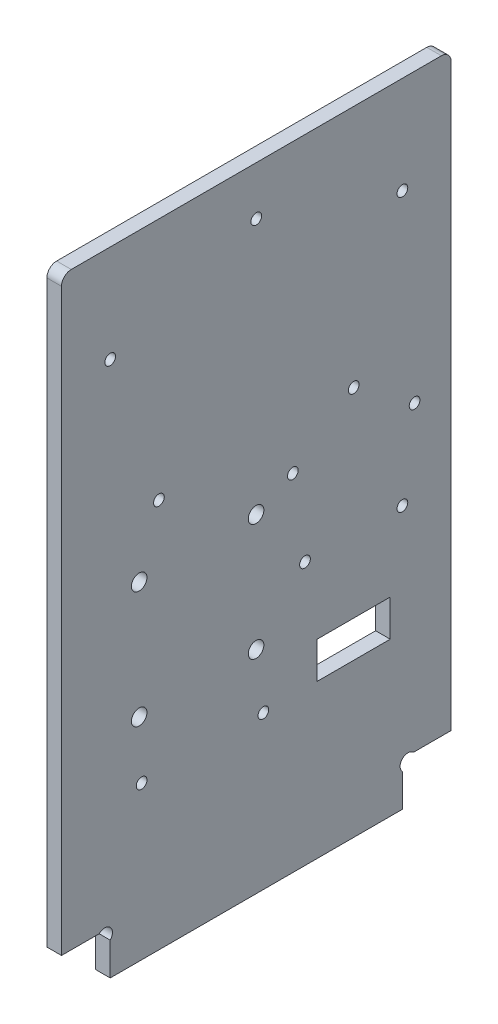
ISO-10303-21;
HEADER;
FILE_DESCRIPTION(('STEP AP214'),'2;1');
FILE_NAME('part.step','',(''),(''),'','','');
FILE_SCHEMA(('AUTOMOTIVE_DESIGN { 1 0 10303 214 1 1 1 1 }'));
ENDSEC;
DATA;
#1=APPLICATION_CONTEXT('core data for automotive mechanical design processes');
#2=APPLICATION_PROTOCOL_DEFINITION('international standard','automotive_design',2000,#1);
#3=PRODUCT_CONTEXT('',#1,'mechanical');
#4=PRODUCT('Part','Part','',(#3));
#5=PRODUCT_RELATED_PRODUCT_CATEGORY('part','',(#4));
#6=PRODUCT_DEFINITION_FORMATION('','',#4);
#7=PRODUCT_DEFINITION_CONTEXT('part definition',#1,'design');
#8=PRODUCT_DEFINITION('design','',#6,#7);
#9=PRODUCT_DEFINITION_SHAPE('','',#8);
#10=(LENGTH_UNIT() NAMED_UNIT(*) SI_UNIT(.MILLI.,.METRE.));
#11=(NAMED_UNIT(*) PLANE_ANGLE_UNIT() SI_UNIT($,.RADIAN.));
#12=(NAMED_UNIT(*) SI_UNIT($,.STERADIAN.) SOLID_ANGLE_UNIT());
#13=UNCERTAINTY_MEASURE_WITH_UNIT(LENGTH_MEASURE(1.E-05),#10,'distance_accuracy_value','');
#14=(GEOMETRIC_REPRESENTATION_CONTEXT(3) GLOBAL_UNCERTAINTY_ASSIGNED_CONTEXT((#13)) GLOBAL_UNIT_ASSIGNED_CONTEXT((#10,
#11,#12)) REPRESENTATION_CONTEXT('',''));
#15=CARTESIAN_POINT('',(0.,0.,0.));
#16=DIRECTION('',(0.,0.,1.));
#17=DIRECTION('',(1.,0.,0.));
#18=AXIS2_PLACEMENT_3D('',#15,#16,#17);
#19=CARTESIAN_POINT('',(3.,7.86862915010153,-8.86862915010152));
#20=DIRECTION('',(-1.,0.,0.));
#21=DIRECTION('',(0.,0.,1.));
#22=AXIS2_PLACEMENT_3D('',#19,#20,#21);
#23=CYLINDRICAL_SURFACE('',#22,1.6);
#24=CARTESIAN_POINT('',(0.,7.86862915010153,-8.86862915010152));
#25=DIRECTION('',(-1.,0.,0.));
#26=DIRECTION('',(0.,0.,-1.));
#27=AXIS2_PLACEMENT_3D('',#24,#25,#26);
#28=CIRCLE('',#27,1.6);
#29=CARTESIAN_POINT('',(0.,9.,-7.73725830020304));
#30=VERTEX_POINT('',#29);
#31=CARTESIAN_POINT('',(0.,6.73725830020305,-10.));
#32=VERTEX_POINT('',#31);
#33=EDGE_CURVE('E259',#30,#32,#28,.T.);
#34=ORIENTED_EDGE('',*,*,#33,.T.);
#35=DIRECTION('',(-1.,0.,0.));
#36=VECTOR('',#35,1.);
#37=CARTESIAN_POINT('',(3.,6.73725830020305,-10.));
#38=LINE('',#37,#36);
#39=CARTESIAN_POINT('',(3.,6.73725830020305,-10.));
#40=VERTEX_POINT('',#39);
#41=EDGE_CURVE('E325',#40,#32,#38,.T.);
#42=ORIENTED_EDGE('',*,*,#41,.F.);
#43=CARTESIAN_POINT('',(3.,7.86862915010153,-8.86862915010152));
#44=DIRECTION('',(-1.,0.,0.));
#45=DIRECTION('',(0.,0.,-1.));
#46=AXIS2_PLACEMENT_3D('',#43,#44,#45);
#47=CIRCLE('',#46,1.6);
#48=CARTESIAN_POINT('',(3.,9.,-7.73725830020304));
#49=VERTEX_POINT('',#48);
#50=EDGE_CURVE('E262',#49,#40,#47,.T.);
#51=ORIENTED_EDGE('',*,*,#50,.F.);
#52=DIRECTION('',(-1.,0.,0.));
#53=VECTOR('',#52,1.);
#54=CARTESIAN_POINT('',(3.,9.,-7.73725830020304));
#55=LINE('',#54,#53);
#56=EDGE_CURVE('E284',#49,#30,#55,.T.);
#57=ORIENTED_EDGE('',*,*,#56,.T.);
#58=EDGE_LOOP('',(#34,#42,#51,#57));
#59=FACE_BOUND('',#58,.T.);
#60=ADVANCED_FACE('F32',(#59),#23,.F.);
#61=CARTESIAN_POINT('',(3.,6.73725830020305,-10.));
#62=DIRECTION('',(0.,0.,-1.));
#63=DIRECTION('',(-1.,0.,0.));
#64=AXIS2_PLACEMENT_3D('',#61,#62,#63);
#65=PLANE('',#64);
#66=DIRECTION('',(0.,-1.,0.));
#67=VECTOR('',#66,1.);
#68=CARTESIAN_POINT('',(0.,6.73725830020305,-10.));
#69=LINE('',#68,#67);
#70=CARTESIAN_POINT('',(0.,0.,-10.));
#71=VERTEX_POINT('',#70);
#72=EDGE_CURVE('E287',#32,#71,#69,.T.);
#73=ORIENTED_EDGE('',*,*,#72,.T.);
#74=DIRECTION('',(-1.,0.,0.));
#75=VECTOR('',#74,1.);
#76=CARTESIAN_POINT('',(3.,0.,-10.));
#77=LINE('',#76,#75);
#78=CARTESIAN_POINT('',(3.,0.,-10.));
#79=VERTEX_POINT('',#78);
#80=EDGE_CURVE('E322',#79,#71,#77,.T.);
#81=ORIENTED_EDGE('',*,*,#80,.F.);
#82=DIRECTION('',(0.,-1.,0.));
#83=VECTOR('',#82,1.);
#84=CARTESIAN_POINT('',(3.,6.73725830020305,-10.));
#85=LINE('',#84,#83);
#86=EDGE_CURVE('E265',#40,#79,#85,.T.);
#87=ORIENTED_EDGE('',*,*,#86,.F.);
#88=ORIENTED_EDGE('',*,*,#41,.T.);
#89=EDGE_LOOP('',(#73,#81,#87,#88));
#90=FACE_BOUND('',#89,.T.);
#91=ADVANCED_FACE('F376',(#90),#65,.F.);
#92=CARTESIAN_POINT('',(3.,0.,-10.));
#93=DIRECTION('',(0.,1.,0.));
#94=DIRECTION('',(0.,0.,1.));
#95=AXIS2_PLACEMENT_3D('',#92,#93,#94);
#96=PLANE('',#95);
#97=DIRECTION('',(0.,0.,-1.));
#98=VECTOR('',#97,1.);
#99=CARTESIAN_POINT('',(0.,0.,-10.));
#100=LINE('',#99,#98);
#101=CARTESIAN_POINT('',(0.,0.,-70.));
#102=VERTEX_POINT('',#101);
#103=EDGE_CURVE('E289',#71,#102,#100,.T.);
#104=ORIENTED_EDGE('',*,*,#103,.T.);
#105=DIRECTION('',(-1.,0.,0.));
#106=VECTOR('',#105,1.);
#107=CARTESIAN_POINT('',(3.,0.,-70.));
#108=LINE('',#107,#106);
#109=CARTESIAN_POINT('',(3.,0.,-70.));
#110=VERTEX_POINT('',#109);
#111=EDGE_CURVE('E319',#110,#102,#108,.T.);
#112=ORIENTED_EDGE('',*,*,#111,.F.);
#113=DIRECTION('',(0.,0.,-1.));
#114=VECTOR('',#113,1.);
#115=CARTESIAN_POINT('',(3.,0.,-10.));
#116=LINE('',#115,#114);
#117=EDGE_CURVE('E268',#79,#110,#116,.T.);
#118=ORIENTED_EDGE('',*,*,#117,.F.);
#119=ORIENTED_EDGE('',*,*,#80,.T.);
#120=EDGE_LOOP('',(#104,#112,#118,#119));
#121=FACE_BOUND('',#120,.T.);
#122=ADVANCED_FACE('F370',(#121),#96,.F.);
#123=CARTESIAN_POINT('',(3.,6.73725830020307,-70.));
#124=DIRECTION('',(0.,0.,1.));
#125=DIRECTION('',(0.,-1.,0.));
#126=AXIS2_PLACEMENT_3D('',#123,#124,#125);
#127=PLANE('',#126);
#128=DIRECTION('',(0.,1.,0.));
#129=VECTOR('',#128,1.);
#130=CARTESIAN_POINT('',(0.,6.73725830020307,-70.));
#131=LINE('',#130,#129);
#132=CARTESIAN_POINT('',(0.,6.73725830020307,-70.));
#133=VERTEX_POINT('',#132);
#134=EDGE_CURVE('E291',#102,#133,#131,.T.);
#135=ORIENTED_EDGE('',*,*,#134,.T.);
#136=DIRECTION('',(-1.,0.,0.));
#137=VECTOR('',#136,1.);
#138=CARTESIAN_POINT('',(3.,6.73725830020307,-70.));
#139=LINE('',#138,#137);
#140=CARTESIAN_POINT('',(3.,6.73725830020307,-70.));
#141=VERTEX_POINT('',#140);
#142=EDGE_CURVE('E316',#141,#133,#139,.T.);
#143=ORIENTED_EDGE('',*,*,#142,.F.);
#144=DIRECTION('',(0.,1.,0.));
#145=VECTOR('',#144,1.);
#146=CARTESIAN_POINT('',(3.,6.73725830020307,-70.));
#147=LINE('',#146,#145);
#148=EDGE_CURVE('E270',#110,#141,#147,.T.);
#149=ORIENTED_EDGE('',*,*,#148,.F.);
#150=ORIENTED_EDGE('',*,*,#111,.T.);
#151=EDGE_LOOP('',(#135,#143,#149,#150));
#152=FACE_BOUND('',#151,.T.);
#153=ADVANCED_FACE('F366',(#152),#127,.F.);
#154=CARTESIAN_POINT('',(3.,7.86862915010154,-71.1313708498985));
#155=DIRECTION('',(-1.,0.,0.));
#156=DIRECTION('',(0.,0.,1.));
#157=AXIS2_PLACEMENT_3D('',#154,#155,#156);
#158=CYLINDRICAL_SURFACE('',#157,1.6);
#159=CARTESIAN_POINT('',(0.,7.86862915010154,-71.1313708498985));
#160=DIRECTION('',(-1.,0.,0.));
#161=DIRECTION('',(0.,0.,1.));
#162=AXIS2_PLACEMENT_3D('',#159,#160,#161);
#163=CIRCLE('',#162,1.6);
#164=CARTESIAN_POINT('',(0.,8.99999999999999,-72.262741699797));
#165=VERTEX_POINT('',#164);
#166=EDGE_CURVE('E293',#133,#165,#163,.T.);
#167=ORIENTED_EDGE('',*,*,#166,.T.);
#168=DIRECTION('',(-1.,0.,0.));
#169=VECTOR('',#168,1.);
#170=CARTESIAN_POINT('',(3.,8.99999999999999,-72.262741699797));
#171=LINE('',#170,#169);
#172=CARTESIAN_POINT('',(3.,8.99999999999999,-72.262741699797));
#173=VERTEX_POINT('',#172);
#174=EDGE_CURVE('E313',#173,#165,#171,.T.);
#175=ORIENTED_EDGE('',*,*,#174,.F.);
#176=CARTESIAN_POINT('',(3.,7.86862915010154,-71.1313708498985));
#177=DIRECTION('',(-1.,0.,0.));
#178=DIRECTION('',(0.,0.,1.));
#179=AXIS2_PLACEMENT_3D('',#176,#177,#178);
#180=CIRCLE('',#179,1.6);
#181=EDGE_CURVE('E272',#141,#173,#180,.T.);
#182=ORIENTED_EDGE('',*,*,#181,.F.);
#183=ORIENTED_EDGE('',*,*,#142,.T.);
#184=EDGE_LOOP('',(#167,#175,#182,#183));
#185=FACE_BOUND('',#184,.T.);
#186=ADVANCED_FACE('F361',(#185),#158,.F.);
#187=CARTESIAN_POINT('',(3.,8.99999999999999,-72.262741699797));
#188=DIRECTION('',(0.,1.,0.));
#189=DIRECTION('',(0.,0.,1.));
#190=AXIS2_PLACEMENT_3D('',#187,#188,#189);
#191=PLANE('',#190);
#192=DIRECTION('',(0.,0.,-1.));
#193=VECTOR('',#192,1.);
#194=CARTESIAN_POINT('',(0.,8.99999999999999,-72.262741699797));
#195=LINE('',#194,#193);
#196=CARTESIAN_POINT('',(0.,8.99999999999999,-80.));
#197=VERTEX_POINT('',#196);
#198=EDGE_CURVE('E295',#165,#197,#195,.T.);
#199=ORIENTED_EDGE('',*,*,#198,.T.);
#200=DIRECTION('',(-1.,0.,0.));
#201=VECTOR('',#200,1.);
#202=CARTESIAN_POINT('',(3.,8.99999999999999,-80.));
#203=LINE('',#202,#201);
#204=CARTESIAN_POINT('',(3.,8.99999999999999,-80.));
#205=VERTEX_POINT('',#204);
#206=EDGE_CURVE('E310',#205,#197,#203,.T.);
#207=ORIENTED_EDGE('',*,*,#206,.F.);
#208=DIRECTION('',(0.,0.,-1.));
#209=VECTOR('',#208,1.);
#210=CARTESIAN_POINT('',(3.,8.99999999999999,-72.262741699797));
#211=LINE('',#210,#209);
#212=EDGE_CURVE('E274',#173,#205,#211,.T.);
#213=ORIENTED_EDGE('',*,*,#212,.F.);
#214=ORIENTED_EDGE('',*,*,#174,.T.);
#215=EDGE_LOOP('',(#199,#207,#213,#214));
#216=FACE_BOUND('',#215,.T.);
#217=ADVANCED_FACE('F355',(#216),#191,.F.);
#218=CARTESIAN_POINT('',(3.,130.,-80.));
#219=DIRECTION('',(0.,0.,1.));
#220=DIRECTION('',(0.,-1.,0.));
#221=AXIS2_PLACEMENT_3D('',#218,#219,#220);
#222=PLANE('',#221);
#223=DIRECTION('',(0.,1.,0.));
#224=VECTOR('',#223,1.);
#225=CARTESIAN_POINT('',(0.,130.,-80.));
#226=LINE('',#225,#224);
#227=CARTESIAN_POINT('',(0.,128.,-80.));
#228=VERTEX_POINT('',#227);
#229=EDGE_CURVE('E297',#197,#228,#226,.T.);
#230=ORIENTED_EDGE('',*,*,#229,.T.);
#231=DIRECTION('',(-1.,0.,0.));
#232=VECTOR('',#231,1.);
#233=CARTESIAN_POINT('',(3.,128.,-80.));
#234=LINE('',#233,#232);
#235=CARTESIAN_POINT('',(3.,128.,-80.));
#236=VERTEX_POINT('',#235);
#237=EDGE_CURVE('E55',#228,#236,#234,.F.);
#238=ORIENTED_EDGE('',*,*,#237,.T.);
#239=DIRECTION('',(0.,1.,0.));
#240=VECTOR('',#239,1.);
#241=CARTESIAN_POINT('',(3.,130.,-80.));
#242=LINE('',#241,#240);
#243=EDGE_CURVE('E276',#205,#236,#242,.T.);
#244=ORIENTED_EDGE('',*,*,#243,.F.);
#245=ORIENTED_EDGE('',*,*,#206,.T.);
#246=EDGE_LOOP('',(#230,#238,#244,#245));
#247=FACE_BOUND('',#246,.T.);
#248=ADVANCED_FACE('F351',(#247),#222,.F.);
#249=CARTESIAN_POINT('',(3.,130.,0.));
#250=DIRECTION('',(0.,-1.,0.));
#251=DIRECTION('',(0.,0.,-1.));
#252=AXIS2_PLACEMENT_3D('',#249,#250,#251);
#253=PLANE('',#252);
#254=DIRECTION('',(0.,0.,1.));
#255=VECTOR('',#254,1.);
#256=CARTESIAN_POINT('',(3.,130.,0.));
#257=LINE('',#256,#255);
#258=CARTESIAN_POINT('',(3.,130.,-78.));
#259=VERTEX_POINT('',#258);
#260=CARTESIAN_POINT('',(3.,130.,-2.));
#261=VERTEX_POINT('',#260);
#262=EDGE_CURVE('E278',#259,#261,#257,.T.);
#263=ORIENTED_EDGE('',*,*,#262,.F.);
#264=DIRECTION('',(-1.,0.,0.));
#265=VECTOR('',#264,1.);
#266=CARTESIAN_POINT('',(3.,130.,-78.));
#267=LINE('',#266,#265);
#268=CARTESIAN_POINT('',(0.,130.,-78.));
#269=VERTEX_POINT('',#268);
#270=EDGE_CURVE('E330',#259,#269,#267,.T.);
#271=ORIENTED_EDGE('',*,*,#270,.T.);
#272=DIRECTION('',(0.,0.,1.));
#273=VECTOR('',#272,1.);
#274=CARTESIAN_POINT('',(0.,130.,0.));
#275=LINE('',#274,#273);
#276=CARTESIAN_POINT('',(0.,130.,-2.));
#277=VERTEX_POINT('',#276);
#278=EDGE_CURVE('E299',#269,#277,#275,.T.);
#279=ORIENTED_EDGE('',*,*,#278,.T.);
#280=DIRECTION('',(-1.,0.,0.));
#281=VECTOR('',#280,1.);
#282=CARTESIAN_POINT('',(3.,130.,-2.));
#283=LINE('',#282,#281);
#284=EDGE_CURVE('E328',#277,#261,#283,.F.);
#285=ORIENTED_EDGE('',*,*,#284,.T.);
#286=EDGE_LOOP('',(#263,#271,#279,#285));
#287=FACE_BOUND('',#286,.T.);
#288=ADVANCED_FACE('F343',(#287),#253,.F.);
#289=CARTESIAN_POINT('',(3.,9.,0.));
#290=DIRECTION('',(0.,0.,-1.));
#291=DIRECTION('',(-1.,0.,0.));
#292=AXIS2_PLACEMENT_3D('',#289,#290,#291);
#293=PLANE('',#292);
#294=DIRECTION('',(0.,-1.,0.));
#295=VECTOR('',#294,1.);
#296=CARTESIAN_POINT('',(3.,9.,0.));
#297=LINE('',#296,#295);
#298=CARTESIAN_POINT('',(3.,128.,0.));
#299=VERTEX_POINT('',#298);
#300=CARTESIAN_POINT('',(3.,9.,0.));
#301=VERTEX_POINT('',#300);
#302=EDGE_CURVE('E280',#299,#301,#297,.T.);
#303=ORIENTED_EDGE('',*,*,#302,.F.);
#304=DIRECTION('',(-1.,0.,0.));
#305=VECTOR('',#304,1.);
#306=CARTESIAN_POINT('',(3.,128.,0.));
#307=LINE('',#306,#305);
#308=CARTESIAN_POINT('',(0.,128.,0.));
#309=VERTEX_POINT('',#308);
#310=EDGE_CURVE('E11',#299,#309,#307,.T.);
#311=ORIENTED_EDGE('',*,*,#310,.T.);
#312=DIRECTION('',(0.,-1.,0.));
#313=VECTOR('',#312,1.);
#314=CARTESIAN_POINT('',(0.,9.,0.));
#315=LINE('',#314,#313);
#316=CARTESIAN_POINT('',(0.,9.,0.));
#317=VERTEX_POINT('',#316);
#318=EDGE_CURVE('E302',#309,#317,#315,.T.);
#319=ORIENTED_EDGE('',*,*,#318,.T.);
#320=DIRECTION('',(-1.,0.,0.));
#321=VECTOR('',#320,1.);
#322=CARTESIAN_POINT('',(3.,9.,0.));
#323=LINE('',#322,#321);
#324=EDGE_CURVE('E307',#301,#317,#323,.T.);
#325=ORIENTED_EDGE('',*,*,#324,.F.);
#326=EDGE_LOOP('',(#303,#311,#319,#325));
#327=FACE_BOUND('',#326,.T.);
#328=ADVANCED_FACE('F386',(#327),#293,.F.);
#329=CARTESIAN_POINT('',(3.,9.,-7.73725830020304));
#330=DIRECTION('',(0.,1.,0.));
#331=DIRECTION('',(0.,0.,1.));
#332=AXIS2_PLACEMENT_3D('',#329,#330,#331);
#333=PLANE('',#332);
#334=DIRECTION('',(0.,0.,-1.));
#335=VECTOR('',#334,1.);
#336=CARTESIAN_POINT('',(0.,9.,-7.73725830020304));
#337=LINE('',#336,#335);
#338=EDGE_CURVE('E266',#317,#30,#337,.T.);
#339=ORIENTED_EDGE('',*,*,#338,.T.);
#340=ORIENTED_EDGE('',*,*,#56,.F.);
#341=DIRECTION('',(0.,0.,-1.));
#342=VECTOR('',#341,1.);
#343=CARTESIAN_POINT('',(3.,9.,-7.73725830020304));
#344=LINE('',#343,#342);
#345=EDGE_CURVE('E282',#301,#49,#344,.T.);
#346=ORIENTED_EDGE('',*,*,#345,.F.);
#347=ORIENTED_EDGE('',*,*,#324,.T.);
#348=EDGE_LOOP('',(#339,#340,#346,#347));
#349=FACE_BOUND('',#348,.T.);
#350=ADVANCED_FACE('F382',(#349),#333,.F.);
#351=CARTESIAN_POINT('',(3.,7.86862915010153,-8.86862915010152));
#352=DIRECTION('',(1.,0.,0.));
#353=DIRECTION('',(0.,0.,-1.));
#354=AXIS2_PLACEMENT_3D('',#351,#352,#353);
#355=PLANE('',#354);
#356=CARTESIAN_POINT('',(3.,31.45,-16.45));
#357=DIRECTION('',(1.,0.,0.));
#358=DIRECTION('',(0.,0.,-1.));
#359=AXIS2_PLACEMENT_3D('',#356,#357,#358);
#360=CIRCLE('',#359,1.1);
#361=CARTESIAN_POINT('',(3.,31.45,-17.55));
#362=VERTEX_POINT('',#361);
#363=EDGE_CURVE('E500',#362,#362,#360,.T.);
#364=ORIENTED_EDGE('',*,*,#363,.F.);
#365=EDGE_LOOP('',(#364));
#366=FACE_BOUND('',#365,.T.);
#367=CARTESIAN_POINT('',(3.,31.45,-41.45));
#368=DIRECTION('',(1.,0.,0.));
#369=DIRECTION('',(0.,0.,-1.));
#370=AXIS2_PLACEMENT_3D('',#367,#368,#369);
#371=CIRCLE('',#370,1.1);
#372=CARTESIAN_POINT('',(3.,31.45,-42.55));
#373=VERTEX_POINT('',#372);
#374=EDGE_CURVE('E505',#373,#373,#371,.T.);
#375=ORIENTED_EDGE('',*,*,#374,.F.);
#376=EDGE_LOOP('',(#375));
#377=FACE_BOUND('',#376,.T.);
#378=CARTESIAN_POINT('',(3.,71.,-47.5));
#379=DIRECTION('',(1.,0.,0.));
#380=DIRECTION('',(0.,0.,-1.));
#381=AXIS2_PLACEMENT_3D('',#378,#379,#380);
#382=CIRCLE('',#381,1.1);
#383=CARTESIAN_POINT('',(3.,71.,-48.6));
#384=VERTEX_POINT('',#383);
#385=EDGE_CURVE('E513',#384,#384,#382,.T.);
#386=ORIENTED_EDGE('',*,*,#385,.F.);
#387=EDGE_LOOP('',(#386));
#388=FACE_BOUND('',#387,.T.);
#389=CARTESIAN_POINT('',(3.,71.,-72.5));
#390=DIRECTION('',(1.,0.,0.));
#391=DIRECTION('',(0.,0.,-1.));
#392=AXIS2_PLACEMENT_3D('',#389,#390,#391);
#393=CIRCLE('',#392,1.10000000000001);
#394=CARTESIAN_POINT('',(3.,71.,-73.6));
#395=VERTEX_POINT('',#394);
#396=EDGE_CURVE('E179',#395,#395,#393,.T.);
#397=ORIENTED_EDGE('',*,*,#396,.F.);
#398=EDGE_LOOP('',(#397));
#399=FACE_BOUND('',#398,.T.);
#400=DIRECTION('',(0.,-1.,0.));
#401=VECTOR('',#400,1.);
#402=CARTESIAN_POINT('',(3.,39.,-67.5));
#403=LINE('',#402,#401);
#404=CARTESIAN_POINT('',(3.,39.,-67.5));
#405=VERTEX_POINT('',#404);
#406=CARTESIAN_POINT('',(3.,31.5,-67.5));
#407=VERTEX_POINT('',#406);
#408=EDGE_CURVE('E152',#405,#407,#403,.T.);
#409=ORIENTED_EDGE('',*,*,#408,.T.);
#410=DIRECTION('',(0.,0.,1.));
#411=VECTOR('',#410,1.);
#412=CARTESIAN_POINT('',(3.,31.5,-67.5));
#413=LINE('',#412,#411);
#414=CARTESIAN_POINT('',(3.,31.5,-52.5));
#415=VERTEX_POINT('',#414);
#416=EDGE_CURVE('E164',#407,#415,#413,.T.);
#417=ORIENTED_EDGE('',*,*,#416,.T.);
#418=DIRECTION('',(0.,1.,0.));
#419=VECTOR('',#418,1.);
#420=CARTESIAN_POINT('',(3.,39.,-52.5));
#421=LINE('',#420,#419);
#422=CARTESIAN_POINT('',(3.,39.,-52.5));
#423=VERTEX_POINT('',#422);
#424=EDGE_CURVE('E168',#415,#423,#421,.T.);
#425=ORIENTED_EDGE('',*,*,#424,.T.);
#426=DIRECTION('',(0.,0.,-1.));
#427=VECTOR('',#426,1.);
#428=CARTESIAN_POINT('',(3.,39.,-67.5));
#429=LINE('',#428,#427);
#430=EDGE_CURVE('E160',#423,#405,#429,.T.);
#431=ORIENTED_EDGE('',*,*,#430,.T.);
#432=EDGE_LOOP('',(#409,#417,#425,#431));
#433=FACE_BOUND('',#432,.T.);
#434=CARTESIAN_POINT('',(3.,67.45,-39.95));
#435=DIRECTION('',(1.,0.,0.));
#436=DIRECTION('',(0.,0.,-1.));
#437=AXIS2_PLACEMENT_3D('',#434,#435,#436);
#438=CIRCLE('',#437,1.6);
#439=CARTESIAN_POINT('',(3.,67.45,-41.55));
#440=VERTEX_POINT('',#439);
#441=EDGE_CURVE('E192',#440,#440,#438,.T.);
#442=ORIENTED_EDGE('',*,*,#441,.F.);
#443=EDGE_LOOP('',(#442));
#444=FACE_BOUND('',#443,.T.);
#445=CARTESIAN_POINT('',(3.,43.45,-39.95));
#446=DIRECTION('',(1.,0.,0.));
#447=DIRECTION('',(0.,0.,-1.));
#448=AXIS2_PLACEMENT_3D('',#445,#446,#447);
#449=CIRCLE('',#448,1.6);
#450=CARTESIAN_POINT('',(3.,43.45,-41.55));
#451=VERTEX_POINT('',#450);
#452=EDGE_CURVE('E199',#451,#451,#449,.T.);
#453=ORIENTED_EDGE('',*,*,#452,.F.);
#454=EDGE_LOOP('',(#453));
#455=FACE_BOUND('',#454,.T.);
#456=CARTESIAN_POINT('',(3.,43.45,-15.95));
#457=DIRECTION('',(1.,0.,0.));
#458=DIRECTION('',(0.,0.,-1.));
#459=AXIS2_PLACEMENT_3D('',#456,#457,#458);
#460=CIRCLE('',#459,1.6);
#461=CARTESIAN_POINT('',(3.,43.45,-17.55));
#462=VERTEX_POINT('',#461);
#463=EDGE_CURVE('E205',#462,#462,#460,.T.);
#464=ORIENTED_EDGE('',*,*,#463,.F.);
#465=EDGE_LOOP('',(#464));
#466=FACE_BOUND('',#465,.T.);
#467=CARTESIAN_POINT('',(3.,67.45,-15.95));
#468=DIRECTION('',(1.,0.,0.));
#469=DIRECTION('',(0.,0.,-1.));
#470=AXIS2_PLACEMENT_3D('',#467,#468,#469);
#471=CIRCLE('',#470,1.6);
#472=CARTESIAN_POINT('',(3.,67.45,-17.55));
#473=VERTEX_POINT('',#472);
#474=EDGE_CURVE('E211',#473,#473,#471,.T.);
#475=ORIENTED_EDGE('',*,*,#474,.F.);
#476=EDGE_LOOP('',(#475));
#477=FACE_BOUND('',#476,.T.);
#478=CARTESIAN_POINT('',(3.,120.,-40.));
#479=DIRECTION('',(1.,0.,0.));
#480=DIRECTION('',(0.,0.,-1.));
#481=AXIS2_PLACEMENT_3D('',#478,#479,#480);
#482=CIRCLE('',#481,1.1);
#483=CARTESIAN_POINT('',(3.,120.,-41.1));
#484=VERTEX_POINT('',#483);
#485=EDGE_CURVE('E217',#484,#484,#482,.T.);
#486=ORIENTED_EDGE('',*,*,#485,.F.);
#487=EDGE_LOOP('',(#486));
#488=FACE_BOUND('',#487,.T.);
#489=CARTESIAN_POINT('',(3.,80.,-20.));
#490=DIRECTION('',(1.,0.,0.));
#491=DIRECTION('',(0.,0.,1.));
#492=AXIS2_PLACEMENT_3D('',#489,#490,#491);
#493=CIRCLE('',#492,1.1);
#494=CARTESIAN_POINT('',(3.,80.,-18.9));
#495=VERTEX_POINT('',#494);
#496=EDGE_CURVE('E223',#495,#495,#493,.T.);
#497=ORIENTED_EDGE('',*,*,#496,.F.);
#498=EDGE_LOOP('',(#497));
#499=FACE_BOUND('',#498,.T.);
#500=CARTESIAN_POINT('',(3.,54.,-70.));
#501=DIRECTION('',(1.,0.,0.));
#502=DIRECTION('',(0.,0.,-1.));
#503=AXIS2_PLACEMENT_3D('',#500,#501,#502);
#504=CIRCLE('',#503,1.10000000000001);
#505=CARTESIAN_POINT('',(3.,54.,-71.1));
#506=VERTEX_POINT('',#505);
#507=EDGE_CURVE('E229',#506,#506,#504,.T.);
#508=ORIENTED_EDGE('',*,*,#507,.F.);
#509=EDGE_LOOP('',(#508));
#510=FACE_BOUND('',#509,.T.);
#511=CARTESIAN_POINT('',(3.,54.,-50.));
#512=DIRECTION('',(1.,0.,0.));
#513=DIRECTION('',(0.,0.,-1.));
#514=AXIS2_PLACEMENT_3D('',#511,#512,#513);
#515=CIRCLE('',#514,1.1);
#516=CARTESIAN_POINT('',(3.,54.,-51.1));
#517=VERTEX_POINT('',#516);
#518=EDGE_CURVE('E235',#517,#517,#515,.T.);
#519=ORIENTED_EDGE('',*,*,#518,.F.);
#520=EDGE_LOOP('',(#519));
#521=FACE_BOUND('',#520,.T.);
#522=CARTESIAN_POINT('',(3.,110.,-70.));
#523=DIRECTION('',(1.,0.,0.));
#524=DIRECTION('',(0.,0.,-1.));
#525=AXIS2_PLACEMENT_3D('',#522,#523,#524);
#526=CIRCLE('',#525,1.10000000000001);
#527=CARTESIAN_POINT('',(3.,110.,-71.1));
#528=VERTEX_POINT('',#527);
#529=EDGE_CURVE('E241',#528,#528,#526,.T.);
#530=ORIENTED_EDGE('',*,*,#529,.F.);
#531=EDGE_LOOP('',(#530));
#532=FACE_BOUND('',#531,.T.);
#533=CARTESIAN_POINT('',(3.,80.,-60.));
#534=DIRECTION('',(1.,0.,0.));
#535=DIRECTION('',(0.,0.,-1.));
#536=AXIS2_PLACEMENT_3D('',#533,#534,#535);
#537=CIRCLE('',#536,1.1);
#538=CARTESIAN_POINT('',(3.,80.,-61.1));
#539=VERTEX_POINT('',#538);
#540=EDGE_CURVE('E247',#539,#539,#537,.T.);
#541=ORIENTED_EDGE('',*,*,#540,.F.);
#542=EDGE_LOOP('',(#541));
#543=FACE_BOUND('',#542,.T.);
#544=CARTESIAN_POINT('',(3.,110.,-10.));
#545=DIRECTION('',(1.,0.,0.));
#546=DIRECTION('',(0.,0.,-1.));
#547=AXIS2_PLACEMENT_3D('',#544,#545,#546);
#548=CIRCLE('',#547,1.1);
#549=CARTESIAN_POINT('',(3.,110.,-11.1));
#550=VERTEX_POINT('',#549);
#551=EDGE_CURVE('E253',#550,#550,#548,.T.);
#552=ORIENTED_EDGE('',*,*,#551,.F.);
#553=EDGE_LOOP('',(#552));
#554=FACE_BOUND('',#553,.T.);
#555=ORIENTED_EDGE('',*,*,#243,.T.);
#556=CARTESIAN_POINT('',(3.,128.,-78.));
#557=DIRECTION('',(1.,0.,0.));
#558=DIRECTION('',(0.,0.,-1.));
#559=AXIS2_PLACEMENT_3D('',#556,#557,#558);
#560=CIRCLE('',#559,2.);
#561=EDGE_CURVE('E40',#236,#259,#560,.T.);
#562=ORIENTED_EDGE('',*,*,#561,.T.);
#563=ORIENTED_EDGE('',*,*,#262,.T.);
#564=CARTESIAN_POINT('',(3.,128.,-2.));
#565=DIRECTION('',(1.,0.,0.));
#566=DIRECTION('',(0.,0.,-1.));
#567=AXIS2_PLACEMENT_3D('',#564,#565,#566);
#568=CIRCLE('',#567,2.);
#569=EDGE_CURVE('E47',#261,#299,#568,.T.);
#570=ORIENTED_EDGE('',*,*,#569,.T.);
#571=ORIENTED_EDGE('',*,*,#302,.T.);
#572=ORIENTED_EDGE('',*,*,#345,.T.);
#573=ORIENTED_EDGE('',*,*,#50,.T.);
#574=ORIENTED_EDGE('',*,*,#86,.T.);
#575=ORIENTED_EDGE('',*,*,#117,.T.);
#576=ORIENTED_EDGE('',*,*,#148,.T.);
#577=ORIENTED_EDGE('',*,*,#181,.T.);
#578=ORIENTED_EDGE('',*,*,#212,.T.);
#579=EDGE_LOOP('',(#555,#562,#563,#570,#571,#572,#573,#574,#575,#576,#577,#578));
#580=FACE_BOUND('',#579,.T.);
#581=ADVANCED_FACE('F170',(#366,#377,#388,#399,#433,#444,#455,#466,#477,#488,#499,#510,#521,
#532,#543,#554,#580),#355,.T.);
#582=CARTESIAN_POINT('',(0.,7.86862915010153,-8.86862915010152));
#583=DIRECTION('',(1.,0.,0.));
#584=DIRECTION('',(0.,0.,-1.));
#585=AXIS2_PLACEMENT_3D('',#582,#583,#584);
#586=PLANE('',#585);
#587=CARTESIAN_POINT('',(0.,31.45,-16.45));
#588=DIRECTION('',(1.,0.,0.));
#589=DIRECTION('',(0.,0.,-1.));
#590=AXIS2_PLACEMENT_3D('',#587,#588,#589);
#591=CIRCLE('',#590,1.1);
#592=CARTESIAN_POINT('',(0.,31.45,-17.55));
#593=VERTEX_POINT('',#592);
#594=EDGE_CURVE('E186',#593,#593,#591,.T.);
#595=ORIENTED_EDGE('',*,*,#594,.T.);
#596=EDGE_LOOP('',(#595));
#597=FACE_BOUND('',#596,.T.);
#598=CARTESIAN_POINT('',(0.,31.45,-41.45));
#599=DIRECTION('',(1.,0.,0.));
#600=DIRECTION('',(0.,0.,-1.));
#601=AXIS2_PLACEMENT_3D('',#598,#599,#600);
#602=CIRCLE('',#601,1.1);
#603=CARTESIAN_POINT('',(0.,31.45,-42.55));
#604=VERTEX_POINT('',#603);
#605=EDGE_CURVE('E501',#604,#604,#602,.T.);
#606=ORIENTED_EDGE('',*,*,#605,.T.);
#607=EDGE_LOOP('',(#606));
#608=FACE_BOUND('',#607,.T.);
#609=CARTESIAN_POINT('',(0.,71.,-47.5));
#610=DIRECTION('',(1.,0.,0.));
#611=DIRECTION('',(0.,0.,-1.));
#612=AXIS2_PLACEMENT_3D('',#609,#610,#611);
#613=CIRCLE('',#612,1.1);
#614=CARTESIAN_POINT('',(0.,71.,-48.6));
#615=VERTEX_POINT('',#614);
#616=EDGE_CURVE('E510',#615,#615,#613,.T.);
#617=ORIENTED_EDGE('',*,*,#616,.T.);
#618=EDGE_LOOP('',(#617));
#619=FACE_BOUND('',#618,.T.);
#620=CARTESIAN_POINT('',(0.,71.,-72.5));
#621=DIRECTION('',(1.,0.,0.));
#622=DIRECTION('',(0.,0.,-1.));
#623=AXIS2_PLACEMENT_3D('',#620,#621,#622);
#624=CIRCLE('',#623,1.10000000000001);
#625=CARTESIAN_POINT('',(0.,71.,-73.6));
#626=VERTEX_POINT('',#625);
#627=EDGE_CURVE('E515',#626,#626,#624,.T.);
#628=ORIENTED_EDGE('',*,*,#627,.T.);
#629=EDGE_LOOP('',(#628));
#630=FACE_BOUND('',#629,.T.);
#631=DIRECTION('',(0.,0.,1.));
#632=VECTOR('',#631,1.);
#633=CARTESIAN_POINT('',(0.,31.5,-67.5));
#634=LINE('',#633,#632);
#635=CARTESIAN_POINT('',(0.,31.5,-67.5));
#636=VERTEX_POINT('',#635);
#637=CARTESIAN_POINT('',(0.,31.5,-52.5));
#638=VERTEX_POINT('',#637);
#639=EDGE_CURVE('E185',#636,#638,#634,.T.);
#640=ORIENTED_EDGE('',*,*,#639,.F.);
#641=DIRECTION('',(0.,-1.,0.));
#642=VECTOR('',#641,1.);
#643=CARTESIAN_POINT('',(0.,39.,-67.5));
#644=LINE('',#643,#642);
#645=CARTESIAN_POINT('',(0.,39.,-67.5));
#646=VERTEX_POINT('',#645);
#647=EDGE_CURVE('E155',#646,#636,#644,.T.);
#648=ORIENTED_EDGE('',*,*,#647,.F.);
#649=DIRECTION('',(0.,0.,-1.));
#650=VECTOR('',#649,1.);
#651=CARTESIAN_POINT('',(0.,39.,-67.5));
#652=LINE('',#651,#650);
#653=CARTESIAN_POINT('',(0.,39.,-52.5));
#654=VERTEX_POINT('',#653);
#655=EDGE_CURVE('E173',#654,#646,#652,.T.);
#656=ORIENTED_EDGE('',*,*,#655,.F.);
#657=DIRECTION('',(0.,1.,0.));
#658=VECTOR('',#657,1.);
#659=CARTESIAN_POINT('',(0.,39.,-52.5));
#660=LINE('',#659,#658);
#661=EDGE_CURVE('E176',#638,#654,#660,.T.);
#662=ORIENTED_EDGE('',*,*,#661,.F.);
#663=EDGE_LOOP('',(#640,#648,#656,#662));
#664=FACE_BOUND('',#663,.T.);
#665=CARTESIAN_POINT('',(0.,67.45,-39.95));
#666=DIRECTION('',(1.,0.,0.));
#667=DIRECTION('',(0.,0.,-1.));
#668=AXIS2_PLACEMENT_3D('',#665,#666,#667);
#669=CIRCLE('',#668,1.6);
#670=CARTESIAN_POINT('',(0.,67.45,-41.55));
#671=VERTEX_POINT('',#670);
#672=EDGE_CURVE('E196',#671,#671,#669,.T.);
#673=ORIENTED_EDGE('',*,*,#672,.T.);
#674=EDGE_LOOP('',(#673));
#675=FACE_BOUND('',#674,.T.);
#676=CARTESIAN_POINT('',(0.,43.45,-39.95));
#677=DIRECTION('',(1.,0.,0.));
#678=DIRECTION('',(0.,0.,-1.));
#679=AXIS2_PLACEMENT_3D('',#676,#677,#678);
#680=CIRCLE('',#679,1.6);
#681=CARTESIAN_POINT('',(0.,43.45,-41.55));
#682=VERTEX_POINT('',#681);
#683=EDGE_CURVE('E202',#682,#682,#680,.T.);
#684=ORIENTED_EDGE('',*,*,#683,.T.);
#685=EDGE_LOOP('',(#684));
#686=FACE_BOUND('',#685,.T.);
#687=CARTESIAN_POINT('',(0.,43.45,-15.95));
#688=DIRECTION('',(1.,0.,0.));
#689=DIRECTION('',(0.,0.,-1.));
#690=AXIS2_PLACEMENT_3D('',#687,#688,#689);
#691=CIRCLE('',#690,1.6);
#692=CARTESIAN_POINT('',(0.,43.45,-17.55));
#693=VERTEX_POINT('',#692);
#694=EDGE_CURVE('E208',#693,#693,#691,.T.);
#695=ORIENTED_EDGE('',*,*,#694,.T.);
#696=EDGE_LOOP('',(#695));
#697=FACE_BOUND('',#696,.T.);
#698=CARTESIAN_POINT('',(0.,67.45,-15.95));
#699=DIRECTION('',(1.,0.,0.));
#700=DIRECTION('',(0.,0.,-1.));
#701=AXIS2_PLACEMENT_3D('',#698,#699,#700);
#702=CIRCLE('',#701,1.6);
#703=CARTESIAN_POINT('',(0.,67.45,-17.55));
#704=VERTEX_POINT('',#703);
#705=EDGE_CURVE('E214',#704,#704,#702,.T.);
#706=ORIENTED_EDGE('',*,*,#705,.T.);
#707=EDGE_LOOP('',(#706));
#708=FACE_BOUND('',#707,.T.);
#709=CARTESIAN_POINT('',(0.,120.,-40.));
#710=DIRECTION('',(1.,0.,0.));
#711=DIRECTION('',(0.,0.,-1.));
#712=AXIS2_PLACEMENT_3D('',#709,#710,#711);
#713=CIRCLE('',#712,1.1);
#714=CARTESIAN_POINT('',(0.,120.,-41.1));
#715=VERTEX_POINT('',#714);
#716=EDGE_CURVE('E220',#715,#715,#713,.T.);
#717=ORIENTED_EDGE('',*,*,#716,.T.);
#718=EDGE_LOOP('',(#717));
#719=FACE_BOUND('',#718,.T.);
#720=CARTESIAN_POINT('',(0.,80.,-20.));
#721=DIRECTION('',(1.,0.,0.));
#722=DIRECTION('',(0.,0.,1.));
#723=AXIS2_PLACEMENT_3D('',#720,#721,#722);
#724=CIRCLE('',#723,1.1);
#725=CARTESIAN_POINT('',(0.,80.,-18.9));
#726=VERTEX_POINT('',#725);
#727=EDGE_CURVE('E226',#726,#726,#724,.T.);
#728=ORIENTED_EDGE('',*,*,#727,.T.);
#729=EDGE_LOOP('',(#728));
#730=FACE_BOUND('',#729,.T.);
#731=CARTESIAN_POINT('',(0.,54.,-70.));
#732=DIRECTION('',(1.,0.,0.));
#733=DIRECTION('',(0.,0.,-1.));
#734=AXIS2_PLACEMENT_3D('',#731,#732,#733);
#735=CIRCLE('',#734,1.10000000000001);
#736=CARTESIAN_POINT('',(0.,54.,-71.1));
#737=VERTEX_POINT('',#736);
#738=EDGE_CURVE('E232',#737,#737,#735,.T.);
#739=ORIENTED_EDGE('',*,*,#738,.T.);
#740=EDGE_LOOP('',(#739));
#741=FACE_BOUND('',#740,.T.);
#742=CARTESIAN_POINT('',(0.,54.,-50.));
#743=DIRECTION('',(1.,0.,0.));
#744=DIRECTION('',(0.,0.,-1.));
#745=AXIS2_PLACEMENT_3D('',#742,#743,#744);
#746=CIRCLE('',#745,1.1);
#747=CARTESIAN_POINT('',(0.,54.,-51.1));
#748=VERTEX_POINT('',#747);
#749=EDGE_CURVE('E238',#748,#748,#746,.T.);
#750=ORIENTED_EDGE('',*,*,#749,.T.);
#751=EDGE_LOOP('',(#750));
#752=FACE_BOUND('',#751,.T.);
#753=CARTESIAN_POINT('',(0.,110.,-70.));
#754=DIRECTION('',(1.,0.,0.));
#755=DIRECTION('',(0.,0.,-1.));
#756=AXIS2_PLACEMENT_3D('',#753,#754,#755);
#757=CIRCLE('',#756,1.10000000000001);
#758=CARTESIAN_POINT('',(0.,110.,-71.1));
#759=VERTEX_POINT('',#758);
#760=EDGE_CURVE('E244',#759,#759,#757,.T.);
#761=ORIENTED_EDGE('',*,*,#760,.T.);
#762=EDGE_LOOP('',(#761));
#763=FACE_BOUND('',#762,.T.);
#764=CARTESIAN_POINT('',(0.,80.,-60.));
#765=DIRECTION('',(1.,0.,0.));
#766=DIRECTION('',(0.,0.,-1.));
#767=AXIS2_PLACEMENT_3D('',#764,#765,#766);
#768=CIRCLE('',#767,1.1);
#769=CARTESIAN_POINT('',(0.,80.,-61.1));
#770=VERTEX_POINT('',#769);
#771=EDGE_CURVE('E250',#770,#770,#768,.T.);
#772=ORIENTED_EDGE('',*,*,#771,.T.);
#773=EDGE_LOOP('',(#772));
#774=FACE_BOUND('',#773,.T.);
#775=CARTESIAN_POINT('',(0.,110.,-10.));
#776=DIRECTION('',(1.,0.,0.));
#777=DIRECTION('',(0.,0.,-1.));
#778=AXIS2_PLACEMENT_3D('',#775,#776,#777);
#779=CIRCLE('',#778,1.1);
#780=CARTESIAN_POINT('',(0.,110.,-11.1));
#781=VERTEX_POINT('',#780);
#782=EDGE_CURVE('E256',#781,#781,#779,.T.);
#783=ORIENTED_EDGE('',*,*,#782,.T.);
#784=EDGE_LOOP('',(#783));
#785=FACE_BOUND('',#784,.T.);
#786=ORIENTED_EDGE('',*,*,#278,.F.);
#787=CARTESIAN_POINT('',(0.,128.,-78.));
#788=DIRECTION('',(1.,0.,0.));
#789=DIRECTION('',(0.,0.,-1.));
#790=AXIS2_PLACEMENT_3D('',#787,#788,#789);
#791=CIRCLE('',#790,2.);
#792=EDGE_CURVE('E335',#269,#228,#791,.F.);
#793=ORIENTED_EDGE('',*,*,#792,.T.);
#794=ORIENTED_EDGE('',*,*,#229,.F.);
#795=ORIENTED_EDGE('',*,*,#198,.F.);
#796=ORIENTED_EDGE('',*,*,#166,.F.);
#797=ORIENTED_EDGE('',*,*,#134,.F.);
#798=ORIENTED_EDGE('',*,*,#103,.F.);
#799=ORIENTED_EDGE('',*,*,#72,.F.);
#800=ORIENTED_EDGE('',*,*,#33,.F.);
#801=ORIENTED_EDGE('',*,*,#338,.F.);
#802=ORIENTED_EDGE('',*,*,#318,.F.);
#803=CARTESIAN_POINT('',(0.,128.,-2.));
#804=DIRECTION('',(1.,0.,0.));
#805=DIRECTION('',(0.,0.,-1.));
#806=AXIS2_PLACEMENT_3D('',#803,#804,#805);
#807=CIRCLE('',#806,2.);
#808=EDGE_CURVE('E333',#309,#277,#807,.F.);
#809=ORIENTED_EDGE('',*,*,#808,.T.);
#810=EDGE_LOOP('',(#786,#793,#794,#795,#796,#797,#798,#799,#800,#801,#802,#809));
#811=FACE_BOUND('',#810,.T.);
#812=ADVANCED_FACE('F349',(#597,#608,#619,#630,#664,#675,#686,#697,#708,#719,#730,#741,#752,
#763,#774,#785,#811),#586,.F.);
#813=CARTESIAN_POINT('',(0.,110.,-10.));
#814=DIRECTION('',(1.,0.,0.));
#815=DIRECTION('',(0.,0.,-1.));
#816=AXIS2_PLACEMENT_3D('',#813,#814,#815);
#817=CYLINDRICAL_SURFACE('',#816,1.1);
#818=ORIENTED_EDGE('',*,*,#782,.F.);
#819=EDGE_LOOP('',(#818));
#820=FACE_BOUND('',#819,.T.);
#821=ORIENTED_EDGE('',*,*,#551,.T.);
#822=EDGE_LOOP('',(#821));
#823=FACE_BOUND('',#822,.T.);
#824=ADVANCED_FACE('F423',(#820,#823),#817,.F.);
#825=CARTESIAN_POINT('',(0.,80.,-60.));
#826=DIRECTION('',(1.,0.,0.));
#827=DIRECTION('',(0.,0.,-1.));
#828=AXIS2_PLACEMENT_3D('',#825,#826,#827);
#829=CYLINDRICAL_SURFACE('',#828,1.1);
#830=ORIENTED_EDGE('',*,*,#771,.F.);
#831=EDGE_LOOP('',(#830));
#832=FACE_BOUND('',#831,.T.);
#833=ORIENTED_EDGE('',*,*,#540,.T.);
#834=EDGE_LOOP('',(#833));
#835=FACE_BOUND('',#834,.T.);
#836=ADVANCED_FACE('F430',(#832,#835),#829,.F.);
#837=CARTESIAN_POINT('',(0.,110.,-70.));
#838=DIRECTION('',(1.,0.,0.));
#839=DIRECTION('',(0.,0.,-1.));
#840=AXIS2_PLACEMENT_3D('',#837,#838,#839);
#841=CYLINDRICAL_SURFACE('',#840,1.10000000000001);
#842=ORIENTED_EDGE('',*,*,#760,.F.);
#843=EDGE_LOOP('',(#842));
#844=FACE_BOUND('',#843,.T.);
#845=ORIENTED_EDGE('',*,*,#529,.T.);
#846=EDGE_LOOP('',(#845));
#847=FACE_BOUND('',#846,.T.);
#848=ADVANCED_FACE('F434',(#844,#847),#841,.F.);
#849=CARTESIAN_POINT('',(0.,54.,-50.));
#850=DIRECTION('',(1.,0.,0.));
#851=DIRECTION('',(0.,0.,-1.));
#852=AXIS2_PLACEMENT_3D('',#849,#850,#851);
#853=CYLINDRICAL_SURFACE('',#852,1.1);
#854=ORIENTED_EDGE('',*,*,#749,.F.);
#855=EDGE_LOOP('',(#854));
#856=FACE_BOUND('',#855,.T.);
#857=ORIENTED_EDGE('',*,*,#518,.T.);
#858=EDGE_LOOP('',(#857));
#859=FACE_BOUND('',#858,.T.);
#860=ADVANCED_FACE('F438',(#856,#859),#853,.F.);
#861=CARTESIAN_POINT('',(0.,54.,-70.));
#862=DIRECTION('',(1.,0.,0.));
#863=DIRECTION('',(0.,0.,-1.));
#864=AXIS2_PLACEMENT_3D('',#861,#862,#863);
#865=CYLINDRICAL_SURFACE('',#864,1.10000000000001);
#866=ORIENTED_EDGE('',*,*,#738,.F.);
#867=EDGE_LOOP('',(#866));
#868=FACE_BOUND('',#867,.T.);
#869=ORIENTED_EDGE('',*,*,#507,.T.);
#870=EDGE_LOOP('',(#869));
#871=FACE_BOUND('',#870,.T.);
#872=ADVANCED_FACE('F442',(#868,#871),#865,.F.);
#873=CARTESIAN_POINT('',(0.,80.,-20.));
#874=DIRECTION('',(1.,0.,0.));
#875=DIRECTION('',(0.,0.,-1.));
#876=AXIS2_PLACEMENT_3D('',#873,#874,#875);
#877=CYLINDRICAL_SURFACE('',#876,1.1);
#878=ORIENTED_EDGE('',*,*,#727,.F.);
#879=EDGE_LOOP('',(#878));
#880=FACE_BOUND('',#879,.T.);
#881=ORIENTED_EDGE('',*,*,#496,.T.);
#882=EDGE_LOOP('',(#881));
#883=FACE_BOUND('',#882,.T.);
#884=ADVANCED_FACE('F446',(#880,#883),#877,.F.);
#885=CARTESIAN_POINT('',(0.,120.,-40.));
#886=DIRECTION('',(1.,0.,0.));
#887=DIRECTION('',(0.,0.,-1.));
#888=AXIS2_PLACEMENT_3D('',#885,#886,#887);
#889=CYLINDRICAL_SURFACE('',#888,1.1);
#890=ORIENTED_EDGE('',*,*,#716,.F.);
#891=EDGE_LOOP('',(#890));
#892=FACE_BOUND('',#891,.T.);
#893=ORIENTED_EDGE('',*,*,#485,.T.);
#894=EDGE_LOOP('',(#893));
#895=FACE_BOUND('',#894,.T.);
#896=ADVANCED_FACE('F450',(#892,#895),#889,.F.);
#897=CARTESIAN_POINT('',(0.,67.45,-15.95));
#898=DIRECTION('',(1.,0.,0.));
#899=DIRECTION('',(0.,0.,-1.));
#900=AXIS2_PLACEMENT_3D('',#897,#898,#899);
#901=CYLINDRICAL_SURFACE('',#900,1.6);
#902=ORIENTED_EDGE('',*,*,#705,.F.);
#903=EDGE_LOOP('',(#902));
#904=FACE_BOUND('',#903,.T.);
#905=ORIENTED_EDGE('',*,*,#474,.T.);
#906=EDGE_LOOP('',(#905));
#907=FACE_BOUND('',#906,.T.);
#908=ADVANCED_FACE('F454',(#904,#907),#901,.F.);
#909=CARTESIAN_POINT('',(0.,43.45,-15.95));
#910=DIRECTION('',(1.,0.,0.));
#911=DIRECTION('',(0.,0.,-1.));
#912=AXIS2_PLACEMENT_3D('',#909,#910,#911);
#913=CYLINDRICAL_SURFACE('',#912,1.6);
#914=ORIENTED_EDGE('',*,*,#694,.F.);
#915=EDGE_LOOP('',(#914));
#916=FACE_BOUND('',#915,.T.);
#917=ORIENTED_EDGE('',*,*,#463,.T.);
#918=EDGE_LOOP('',(#917));
#919=FACE_BOUND('',#918,.T.);
#920=ADVANCED_FACE('F458',(#916,#919),#913,.F.);
#921=CARTESIAN_POINT('',(0.,43.45,-39.95));
#922=DIRECTION('',(1.,0.,0.));
#923=DIRECTION('',(0.,0.,-1.));
#924=AXIS2_PLACEMENT_3D('',#921,#922,#923);
#925=CYLINDRICAL_SURFACE('',#924,1.6);
#926=ORIENTED_EDGE('',*,*,#683,.F.);
#927=EDGE_LOOP('',(#926));
#928=FACE_BOUND('',#927,.T.);
#929=ORIENTED_EDGE('',*,*,#452,.T.);
#930=EDGE_LOOP('',(#929));
#931=FACE_BOUND('',#930,.T.);
#932=ADVANCED_FACE('F462',(#928,#931),#925,.F.);
#933=CARTESIAN_POINT('',(0.,67.45,-39.95));
#934=DIRECTION('',(1.,0.,0.));
#935=DIRECTION('',(0.,0.,-1.));
#936=AXIS2_PLACEMENT_3D('',#933,#934,#935);
#937=CYLINDRICAL_SURFACE('',#936,1.6);
#938=ORIENTED_EDGE('',*,*,#672,.F.);
#939=EDGE_LOOP('',(#938));
#940=FACE_BOUND('',#939,.T.);
#941=ORIENTED_EDGE('',*,*,#441,.T.);
#942=EDGE_LOOP('',(#941));
#943=FACE_BOUND('',#942,.T.);
#944=ADVANCED_FACE('F466',(#940,#943),#937,.F.);
#945=CARTESIAN_POINT('',(3.,39.,-67.5));
#946=DIRECTION('',(0.,0.,-1.));
#947=DIRECTION('',(-1.,0.,0.));
#948=AXIS2_PLACEMENT_3D('',#945,#946,#947);
#949=PLANE('',#948);
#950=ORIENTED_EDGE('',*,*,#647,.T.);
#951=DIRECTION('',(-1.,0.,0.));
#952=VECTOR('',#951,1.);
#953=CARTESIAN_POINT('',(3.,31.5,-67.5));
#954=LINE('',#953,#952);
#955=EDGE_CURVE('E148',#407,#636,#954,.T.);
#956=ORIENTED_EDGE('',*,*,#955,.F.);
#957=ORIENTED_EDGE('',*,*,#408,.F.);
#958=DIRECTION('',(-1.,0.,0.));
#959=VECTOR('',#958,1.);
#960=CARTESIAN_POINT('',(3.,39.,-67.5));
#961=LINE('',#960,#959);
#962=EDGE_CURVE('E190',#405,#646,#961,.T.);
#963=ORIENTED_EDGE('',*,*,#962,.T.);
#964=EDGE_LOOP('',(#950,#956,#957,#963));
#965=FACE_BOUND('',#964,.T.);
#966=ADVANCED_FACE('F150',(#965),#949,.F.);
#967=CARTESIAN_POINT('',(3.,39.,-67.5));
#968=DIRECTION('',(0.,1.,0.));
#969=DIRECTION('',(0.,0.,1.));
#970=AXIS2_PLACEMENT_3D('',#967,#968,#969);
#971=PLANE('',#970);
#972=ORIENTED_EDGE('',*,*,#655,.T.);
#973=ORIENTED_EDGE('',*,*,#962,.F.);
#974=ORIENTED_EDGE('',*,*,#430,.F.);
#975=DIRECTION('',(-1.,0.,0.));
#976=VECTOR('',#975,1.);
#977=CARTESIAN_POINT('',(3.,39.,-52.5));
#978=LINE('',#977,#976);
#979=EDGE_CURVE('E193',#423,#654,#978,.T.);
#980=ORIENTED_EDGE('',*,*,#979,.T.);
#981=EDGE_LOOP('',(#972,#973,#974,#980));
#982=FACE_BOUND('',#981,.T.);
#983=ADVANCED_FACE('F473',(#982),#971,.F.);
#984=CARTESIAN_POINT('',(3.,39.,-52.5));
#985=DIRECTION('',(0.,0.,1.));
#986=DIRECTION('',(1.,0.,0.));
#987=AXIS2_PLACEMENT_3D('',#984,#985,#986);
#988=PLANE('',#987);
#989=ORIENTED_EDGE('',*,*,#661,.T.);
#990=ORIENTED_EDGE('',*,*,#979,.F.);
#991=ORIENTED_EDGE('',*,*,#424,.F.);
#992=DIRECTION('',(-1.,0.,0.));
#993=VECTOR('',#992,1.);
#994=CARTESIAN_POINT('',(3.,31.5,-52.5));
#995=LINE('',#994,#993);
#996=EDGE_CURVE('E159',#415,#638,#995,.T.);
#997=ORIENTED_EDGE('',*,*,#996,.T.);
#998=EDGE_LOOP('',(#989,#990,#991,#997));
#999=FACE_BOUND('',#998,.T.);
#1000=ADVANCED_FACE('F476',(#999),#988,.F.);
#1001=CARTESIAN_POINT('',(3.,31.5,-67.5));
#1002=DIRECTION('',(0.,-1.,0.));
#1003=DIRECTION('',(0.,0.,-1.));
#1004=AXIS2_PLACEMENT_3D('',#1001,#1002,#1003);
#1005=PLANE('',#1004);
#1006=ORIENTED_EDGE('',*,*,#639,.T.);
#1007=ORIENTED_EDGE('',*,*,#996,.F.);
#1008=ORIENTED_EDGE('',*,*,#416,.F.);
#1009=ORIENTED_EDGE('',*,*,#955,.T.);
#1010=EDGE_LOOP('',(#1006,#1007,#1008,#1009));
#1011=FACE_BOUND('',#1010,.T.);
#1012=ADVANCED_FACE('F165',(#1011),#1005,.F.);
#1013=CARTESIAN_POINT('',(3.,128.,-78.));
#1014=DIRECTION('',(-1.,0.,0.));
#1015=DIRECTION('',(0.,0.,1.));
#1016=AXIS2_PLACEMENT_3D('',#1013,#1014,#1015);
#1017=CYLINDRICAL_SURFACE('',#1016,2.);
#1018=ORIENTED_EDGE('',*,*,#561,.F.);
#1019=ORIENTED_EDGE('',*,*,#237,.F.);
#1020=ORIENTED_EDGE('',*,*,#792,.F.);
#1021=ORIENTED_EDGE('',*,*,#270,.F.);
#1022=EDGE_LOOP('',(#1018,#1019,#1020,#1021));
#1023=FACE_BOUND('',#1022,.T.);
#1024=ADVANCED_FACE('F346',(#1023),#1017,.T.);
#1025=CARTESIAN_POINT('',(3.,128.,-2.));
#1026=DIRECTION('',(-1.,0.,0.));
#1027=DIRECTION('',(0.,0.,1.));
#1028=AXIS2_PLACEMENT_3D('',#1025,#1026,#1027);
#1029=CYLINDRICAL_SURFACE('',#1028,2.);
#1030=ORIENTED_EDGE('',*,*,#569,.F.);
#1031=ORIENTED_EDGE('',*,*,#284,.F.);
#1032=ORIENTED_EDGE('',*,*,#808,.F.);
#1033=ORIENTED_EDGE('',*,*,#310,.F.);
#1034=EDGE_LOOP('',(#1030,#1031,#1032,#1033));
#1035=FACE_BOUND('',#1034,.T.);
#1036=ADVANCED_FACE('F34',(#1035),#1029,.T.);
#1037=CARTESIAN_POINT('',(0.,71.,-72.5));
#1038=DIRECTION('',(1.,0.,0.));
#1039=DIRECTION('',(0.,0.,-1.));
#1040=AXIS2_PLACEMENT_3D('',#1037,#1038,#1039);
#1041=CYLINDRICAL_SURFACE('',#1040,1.10000000000001);
#1042=ORIENTED_EDGE('',*,*,#627,.F.);
#1043=EDGE_LOOP('',(#1042));
#1044=FACE_BOUND('',#1043,.T.);
#1045=ORIENTED_EDGE('',*,*,#396,.T.);
#1046=EDGE_LOOP('',(#1045));
#1047=FACE_BOUND('',#1046,.T.);
#1048=ADVANCED_FACE('F390',(#1044,#1047),#1041,.F.);
#1049=CARTESIAN_POINT('',(0.,71.,-47.5));
#1050=DIRECTION('',(1.,0.,0.));
#1051=DIRECTION('',(0.,0.,-1.));
#1052=AXIS2_PLACEMENT_3D('',#1049,#1050,#1051);
#1053=CYLINDRICAL_SURFACE('',#1052,1.1);
#1054=ORIENTED_EDGE('',*,*,#616,.F.);
#1055=EDGE_LOOP('',(#1054));
#1056=FACE_BOUND('',#1055,.T.);
#1057=ORIENTED_EDGE('',*,*,#385,.T.);
#1058=EDGE_LOOP('',(#1057));
#1059=FACE_BOUND('',#1058,.T.);
#1060=ADVANCED_FACE('F395',(#1056,#1059),#1053,.F.);
#1061=CARTESIAN_POINT('',(0.,31.45,-41.45));
#1062=DIRECTION('',(1.,0.,0.));
#1063=DIRECTION('',(0.,0.,-1.));
#1064=AXIS2_PLACEMENT_3D('',#1061,#1062,#1063);
#1065=CYLINDRICAL_SURFACE('',#1064,1.1);
#1066=ORIENTED_EDGE('',*,*,#605,.F.);
#1067=EDGE_LOOP('',(#1066));
#1068=FACE_BOUND('',#1067,.T.);
#1069=ORIENTED_EDGE('',*,*,#374,.T.);
#1070=EDGE_LOOP('',(#1069));
#1071=FACE_BOUND('',#1070,.T.);
#1072=ADVANCED_FACE('F485',(#1068,#1071),#1065,.F.);
#1073=CARTESIAN_POINT('',(0.,31.45,-16.45));
#1074=DIRECTION('',(1.,0.,0.));
#1075=DIRECTION('',(0.,0.,-1.));
#1076=AXIS2_PLACEMENT_3D('',#1073,#1074,#1075);
#1077=CYLINDRICAL_SURFACE('',#1076,1.1);
#1078=ORIENTED_EDGE('',*,*,#594,.F.);
#1079=EDGE_LOOP('',(#1078));
#1080=FACE_BOUND('',#1079,.T.);
#1081=ORIENTED_EDGE('',*,*,#363,.T.);
#1082=EDGE_LOOP('',(#1081));
#1083=FACE_BOUND('',#1082,.T.);
#1084=ADVANCED_FACE('F489',(#1080,#1083),#1077,.F.);
#1085=CLOSED_SHELL('',(#60,#91,#122,#153,#186,#217,#248,#288,#328,#350,#581,#812,#824,#836,#848,
#860,#872,#884,#896,#908,#920,#932,#944,#966,#983,#1000,#1012,#1024,#1036,#1048,#1060,#1072,#1084));
#1086=MANIFOLD_SOLID_BREP('B2',#1085);
#1087=ADVANCED_BREP_SHAPE_REPRESENTATION('',(#18,#1086),#14);
#1088=SHAPE_DEFINITION_REPRESENTATION(#9,#1087);
ENDSEC;
END-ISO-10303-21;
